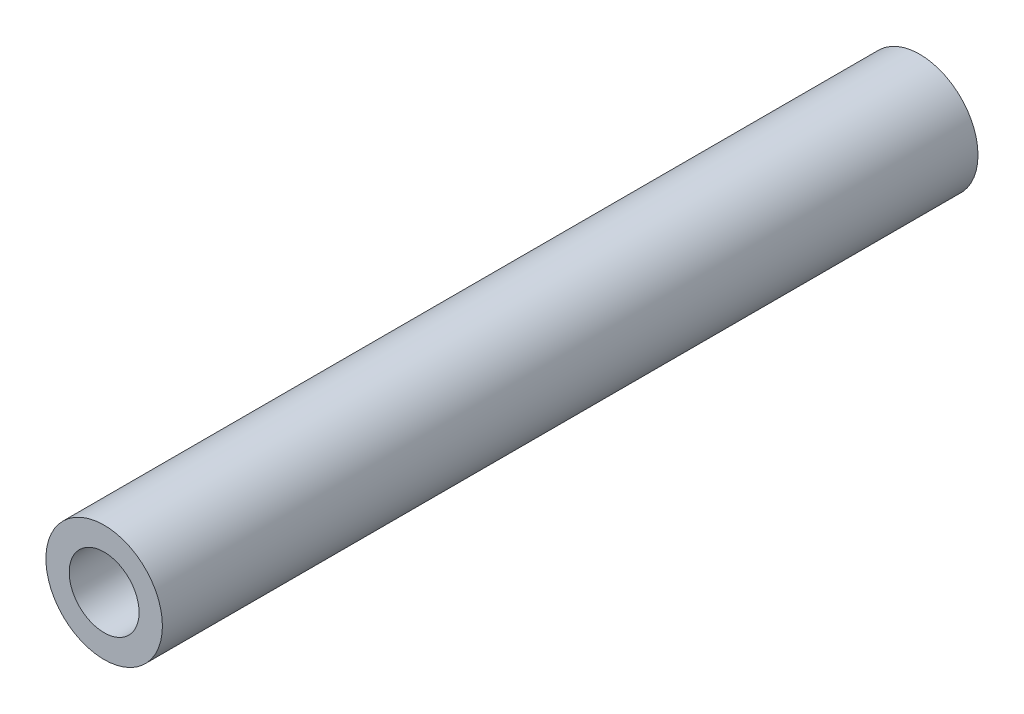
ISO-10303-21;
HEADER;
FILE_DESCRIPTION(('STEP AP214'),'2;1');
FILE_NAME('part.step','',(''),(''),'','','');
FILE_SCHEMA(('AUTOMOTIVE_DESIGN { 1 0 10303 214 1 1 1 1 }'));
ENDSEC;
DATA;
#1=APPLICATION_CONTEXT('core data for automotive mechanical design processes');
#2=APPLICATION_PROTOCOL_DEFINITION('international standard','automotive_design',2000,#1);
#3=PRODUCT_CONTEXT('',#1,'mechanical');
#4=PRODUCT('Part','Part','',(#3));
#5=PRODUCT_RELATED_PRODUCT_CATEGORY('part','',(#4));
#6=PRODUCT_DEFINITION_FORMATION('','',#4);
#7=PRODUCT_DEFINITION_CONTEXT('part definition',#1,'design');
#8=PRODUCT_DEFINITION('design','',#6,#7);
#9=PRODUCT_DEFINITION_SHAPE('','',#8);
#10=(LENGTH_UNIT() NAMED_UNIT(*) SI_UNIT(.MILLI.,.METRE.));
#11=(NAMED_UNIT(*) PLANE_ANGLE_UNIT() SI_UNIT($,.RADIAN.));
#12=(NAMED_UNIT(*) SI_UNIT($,.STERADIAN.) SOLID_ANGLE_UNIT());
#13=UNCERTAINTY_MEASURE_WITH_UNIT(LENGTH_MEASURE(1.E-05),#10,'distance_accuracy_value','');
#14=(GEOMETRIC_REPRESENTATION_CONTEXT(3) GLOBAL_UNCERTAINTY_ASSIGNED_CONTEXT((#13)) GLOBAL_UNIT_ASSIGNED_CONTEXT((#10,
#11,#12)) REPRESENTATION_CONTEXT('',''));
#15=CARTESIAN_POINT('',(0.,0.,0.));
#16=DIRECTION('',(0.,0.,1.));
#17=DIRECTION('',(1.,0.,0.));
#18=AXIS2_PLACEMENT_3D('',#15,#16,#17);
#19=CARTESIAN_POINT('',(0.,0.,17.5));
#20=DIRECTION('',(0.,0.,1.));
#21=DIRECTION('',(1.,0.,0.));
#22=AXIS2_PLACEMENT_3D('',#19,#20,#21);
#23=PLANE('',#22);
#24=CARTESIAN_POINT('',(0.,0.,17.5));
#25=DIRECTION('',(0.,0.,1.));
#26=DIRECTION('',(1.,0.,0.));
#27=AXIS2_PLACEMENT_3D('',#24,#25,#26);
#28=CIRCLE('',#27,2.5);
#29=CARTESIAN_POINT('',(2.5,0.,17.5));
#30=VERTEX_POINT('',#29);
#31=EDGE_CURVE('E10',#30,#30,#28,.T.);
#32=ORIENTED_EDGE('',*,*,#31,.T.);
#33=EDGE_LOOP('',(#32));
#34=FACE_BOUND('',#33,.T.);
#35=CARTESIAN_POINT('',(0.,0.,17.5));
#36=DIRECTION('',(0.,0.,1.));
#37=DIRECTION('',(1.,0.,0.));
#38=AXIS2_PLACEMENT_3D('',#35,#36,#37);
#39=CIRCLE('',#38,1.5);
#40=CARTESIAN_POINT('',(1.5,0.,17.5));
#41=VERTEX_POINT('',#40);
#42=EDGE_CURVE('E42',#41,#41,#39,.T.);
#43=ORIENTED_EDGE('',*,*,#42,.F.);
#44=EDGE_LOOP('',(#43));
#45=FACE_BOUND('',#44,.T.);
#46=ADVANCED_FACE('F31',(#34,#45),#23,.T.);
#47=CARTESIAN_POINT('',(0.,0.,-17.5));
#48=DIRECTION('',(0.,0.,1.));
#49=DIRECTION('',(1.,0.,0.));
#50=AXIS2_PLACEMENT_3D('',#47,#48,#49);
#51=PLANE('',#50);
#52=CARTESIAN_POINT('',(0.,0.,-17.5));
#53=DIRECTION('',(0.,0.,1.));
#54=DIRECTION('',(1.,0.,0.));
#55=AXIS2_PLACEMENT_3D('',#52,#53,#54);
#56=CIRCLE('',#55,2.5);
#57=CARTESIAN_POINT('',(2.5,0.,-17.5));
#58=VERTEX_POINT('',#57);
#59=EDGE_CURVE('E35',#58,#58,#56,.T.);
#60=ORIENTED_EDGE('',*,*,#59,.F.);
#61=EDGE_LOOP('',(#60));
#62=FACE_BOUND('',#61,.T.);
#63=CARTESIAN_POINT('',(0.,0.,-17.5));
#64=DIRECTION('',(0.,0.,1.));
#65=DIRECTION('',(1.,0.,0.));
#66=AXIS2_PLACEMENT_3D('',#63,#64,#65);
#67=CIRCLE('',#66,1.5);
#68=CARTESIAN_POINT('',(1.5,0.,-17.5));
#69=VERTEX_POINT('',#68);
#70=EDGE_CURVE('E44',#69,#69,#67,.T.);
#71=ORIENTED_EDGE('',*,*,#70,.T.);
#72=EDGE_LOOP('',(#71));
#73=FACE_BOUND('',#72,.T.);
#74=ADVANCED_FACE('F54',(#62,#73),#51,.F.);
#75=CARTESIAN_POINT('',(0.,0.,17.5));
#76=DIRECTION('',(0.,0.,-1.));
#77=DIRECTION('',(-1.,0.,0.));
#78=AXIS2_PLACEMENT_3D('',#75,#76,#77);
#79=CYLINDRICAL_SURFACE('',#78,2.5);
#80=ORIENTED_EDGE('',*,*,#31,.F.);
#81=EDGE_LOOP('',(#80));
#82=FACE_BOUND('',#81,.T.);
#83=ORIENTED_EDGE('',*,*,#59,.T.);
#84=EDGE_LOOP('',(#83));
#85=FACE_BOUND('',#84,.T.);
#86=ADVANCED_FACE('F33',(#82,#85),#79,.T.);
#87=CARTESIAN_POINT('',(0.,0.,17.5));
#88=DIRECTION('',(0.,0.,-1.));
#89=DIRECTION('',(-1.,0.,0.));
#90=AXIS2_PLACEMENT_3D('',#87,#88,#89);
#91=CYLINDRICAL_SURFACE('',#90,1.5);
#92=ORIENTED_EDGE('',*,*,#42,.T.);
#93=EDGE_LOOP('',(#92));
#94=FACE_BOUND('',#93,.T.);
#95=ORIENTED_EDGE('',*,*,#70,.F.);
#96=EDGE_LOOP('',(#95));
#97=FACE_BOUND('',#96,.T.);
#98=ADVANCED_FACE('F50',(#94,#97),#91,.F.);
#99=CLOSED_SHELL('',(#46,#74,#86,#98));
#100=MANIFOLD_SOLID_BREP('B2',#99);
#101=ADVANCED_BREP_SHAPE_REPRESENTATION('',(#18,#100),#14);
#102=SHAPE_DEFINITION_REPRESENTATION(#9,#101);
ENDSEC;
END-ISO-10303-21;
